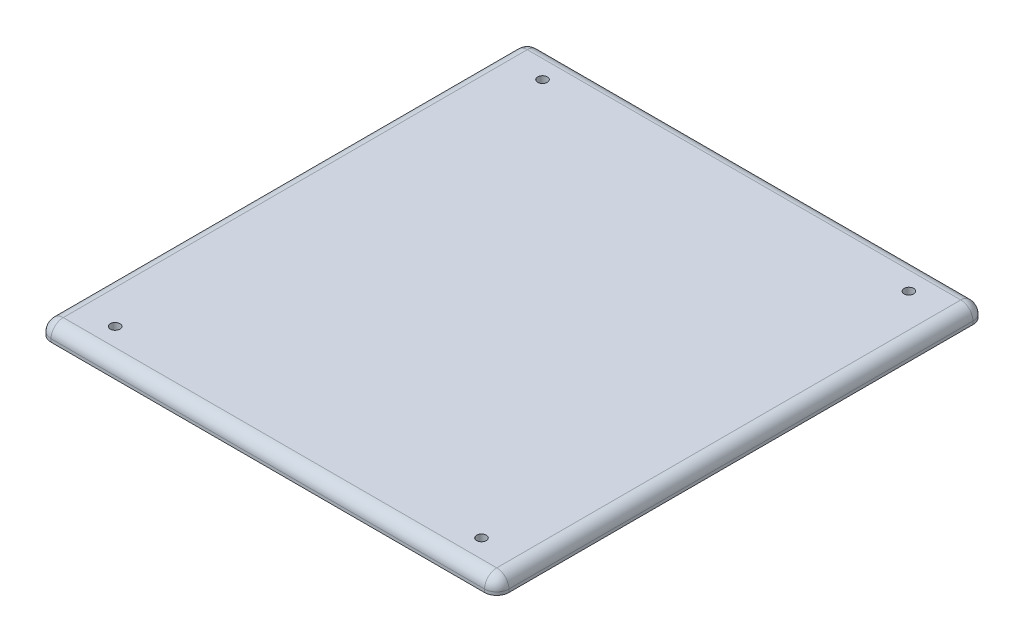
ISO-10303-21;
HEADER;
FILE_DESCRIPTION(('STEP AP214'),'2;1');
FILE_NAME('part.step','',(''),(''),'','','');
FILE_SCHEMA(('AUTOMOTIVE_DESIGN { 1 0 10303 214 1 1 1 1 }'));
ENDSEC;
DATA;
#1=APPLICATION_CONTEXT('core data for automotive mechanical design processes');
#2=APPLICATION_PROTOCOL_DEFINITION('international standard','automotive_design',2000,#1);
#3=PRODUCT_CONTEXT('',#1,'mechanical');
#4=PRODUCT('Part','Part','',(#3));
#5=PRODUCT_RELATED_PRODUCT_CATEGORY('part','',(#4));
#6=PRODUCT_DEFINITION_FORMATION('','',#4);
#7=PRODUCT_DEFINITION_CONTEXT('part definition',#1,'design');
#8=PRODUCT_DEFINITION('design','',#6,#7);
#9=PRODUCT_DEFINITION_SHAPE('','',#8);
#10=(LENGTH_UNIT() NAMED_UNIT(*) SI_UNIT(.MILLI.,.METRE.));
#11=(NAMED_UNIT(*) PLANE_ANGLE_UNIT() SI_UNIT($,.RADIAN.));
#12=(NAMED_UNIT(*) SI_UNIT($,.STERADIAN.) SOLID_ANGLE_UNIT());
#13=UNCERTAINTY_MEASURE_WITH_UNIT(LENGTH_MEASURE(1.E-05),#10,'distance_accuracy_value','');
#14=(GEOMETRIC_REPRESENTATION_CONTEXT(3) GLOBAL_UNCERTAINTY_ASSIGNED_CONTEXT((#13)) GLOBAL_UNIT_ASSIGNED_CONTEXT((#10,
#11,#12)) REPRESENTATION_CONTEXT('',''));
#15=CARTESIAN_POINT('',(0.,0.,0.));
#16=DIRECTION('',(0.,0.,1.));
#17=DIRECTION('',(1.,0.,0.));
#18=AXIS2_PLACEMENT_3D('',#15,#16,#17);
#19=CARTESIAN_POINT('',(-47.625,3.175,50.8));
#20=DIRECTION('',(1.,0.,0.));
#21=DIRECTION('',(0.,0.,-1.));
#22=AXIS2_PLACEMENT_3D('',#19,#20,#21);
#23=PLANE('',#22);
#24=DIRECTION('',(0.,0.,1.));
#25=VECTOR('',#24,1.);
#26=CARTESIAN_POINT('',(-47.625,0.635,-50.8));
#27=LINE('',#26,#25);
#28=CARTESIAN_POINT('',(-47.625,0.635,48.26));
#29=VERTEX_POINT('',#28);
#30=CARTESIAN_POINT('',(-47.625,0.635,-48.26));
#31=VERTEX_POINT('',#30);
#32=EDGE_CURVE('E191',#29,#31,#27,.F.);
#33=ORIENTED_EDGE('',*,*,#32,.T.);
#34=DIRECTION('',(0.,-1.,0.));
#35=VECTOR('',#34,1.);
#36=CARTESIAN_POINT('',(-47.625,3.175,-48.26));
#37=LINE('',#36,#35);
#38=CARTESIAN_POINT('',(-47.625,0.,-48.26));
#39=VERTEX_POINT('',#38);
#40=EDGE_CURVE('E194',#31,#39,#37,.T.);
#41=ORIENTED_EDGE('',*,*,#40,.T.);
#42=DIRECTION('',(0.,0.,1.));
#43=VECTOR('',#42,1.);
#44=CARTESIAN_POINT('',(-47.625,0.,50.8));
#45=LINE('',#44,#43);
#46=CARTESIAN_POINT('',(-47.625,0.,48.26));
#47=VERTEX_POINT('',#46);
#48=EDGE_CURVE('E296',#39,#47,#45,.T.);
#49=ORIENTED_EDGE('',*,*,#48,.T.);
#50=DIRECTION('',(0.,-1.,0.));
#51=VECTOR('',#50,1.);
#52=CARTESIAN_POINT('',(-47.625,3.175,48.26));
#53=LINE('',#52,#51);
#54=EDGE_CURVE('E188',#47,#29,#53,.F.);
#55=ORIENTED_EDGE('',*,*,#54,.T.);
#56=EDGE_LOOP('',(#33,#41,#49,#55));
#57=FACE_BOUND('',#56,.T.);
#58=ADVANCED_FACE('F47',(#57),#23,.F.);
#59=CARTESIAN_POINT('',(47.625,3.175,50.8));
#60=DIRECTION('',(0.,0.,-1.));
#61=DIRECTION('',(-1.,0.,0.));
#62=AXIS2_PLACEMENT_3D('',#59,#60,#61);
#63=PLANE('',#62);
#64=DIRECTION('',(1.,0.,0.));
#65=VECTOR('',#64,1.);
#66=CARTESIAN_POINT('',(47.625,0.,50.8));
#67=LINE('',#66,#65);
#68=CARTESIAN_POINT('',(-45.085,0.,50.8));
#69=VERTEX_POINT('',#68);
#70=CARTESIAN_POINT('',(45.085,0.,50.8));
#71=VERTEX_POINT('',#70);
#72=EDGE_CURVE('E304',#69,#71,#67,.T.);
#73=ORIENTED_EDGE('',*,*,#72,.T.);
#74=DIRECTION('',(0.,-1.,0.));
#75=VECTOR('',#74,1.);
#76=CARTESIAN_POINT('',(45.085,3.175,50.8));
#77=LINE('',#76,#75);
#78=CARTESIAN_POINT('',(45.085,0.635,50.8));
#79=VERTEX_POINT('',#78);
#80=EDGE_CURVE('E185',#71,#79,#77,.F.);
#81=ORIENTED_EDGE('',*,*,#80,.T.);
#82=DIRECTION('',(1.,0.,0.));
#83=VECTOR('',#82,1.);
#84=CARTESIAN_POINT('',(-47.625,0.635,50.8));
#85=LINE('',#84,#83);
#86=CARTESIAN_POINT('',(-45.085,0.635,50.8));
#87=VERTEX_POINT('',#86);
#88=EDGE_CURVE('E182',#79,#87,#85,.F.);
#89=ORIENTED_EDGE('',*,*,#88,.T.);
#90=DIRECTION('',(0.,-1.,0.));
#91=VECTOR('',#90,1.);
#92=CARTESIAN_POINT('',(-45.085,3.175,50.8));
#93=LINE('',#92,#91);
#94=EDGE_CURVE('E179',#87,#69,#93,.T.);
#95=ORIENTED_EDGE('',*,*,#94,.T.);
#96=EDGE_LOOP('',(#73,#81,#89,#95));
#97=FACE_BOUND('',#96,.T.);
#98=ADVANCED_FACE('F365',(#97),#63,.F.);
#99=CARTESIAN_POINT('',(47.625,3.175,50.8));
#100=DIRECTION('',(-1.,0.,0.));
#101=DIRECTION('',(0.,0.,1.));
#102=AXIS2_PLACEMENT_3D('',#99,#100,#101);
#103=PLANE('',#102);
#104=DIRECTION('',(0.,0.,-1.));
#105=VECTOR('',#104,1.);
#106=CARTESIAN_POINT('',(47.625,0.,50.8));
#107=LINE('',#106,#105);
#108=CARTESIAN_POINT('',(47.625,0.,48.26));
#109=VERTEX_POINT('',#108);
#110=CARTESIAN_POINT('',(47.625,0.,-48.26));
#111=VERTEX_POINT('',#110);
#112=EDGE_CURVE('E323',#109,#111,#107,.T.);
#113=ORIENTED_EDGE('',*,*,#112,.T.);
#114=DIRECTION('',(0.,-1.,0.));
#115=VECTOR('',#114,1.);
#116=CARTESIAN_POINT('',(47.625,3.175,-48.26));
#117=LINE('',#116,#115);
#118=CARTESIAN_POINT('',(47.625,0.635,-48.26));
#119=VERTEX_POINT('',#118);
#120=EDGE_CURVE('E176',#111,#119,#117,.F.);
#121=ORIENTED_EDGE('',*,*,#120,.T.);
#122=DIRECTION('',(0.,0.,-1.));
#123=VECTOR('',#122,1.);
#124=CARTESIAN_POINT('',(47.625,0.635,50.8));
#125=LINE('',#124,#123);
#126=CARTESIAN_POINT('',(47.625,0.635,48.26));
#127=VERTEX_POINT('',#126);
#128=EDGE_CURVE('E133',#119,#127,#125,.F.);
#129=ORIENTED_EDGE('',*,*,#128,.T.);
#130=DIRECTION('',(0.,-1.,0.));
#131=VECTOR('',#130,1.);
#132=CARTESIAN_POINT('',(47.625,3.175,48.26));
#133=LINE('',#132,#131);
#134=EDGE_CURVE('E166',#127,#109,#133,.T.);
#135=ORIENTED_EDGE('',*,*,#134,.T.);
#136=EDGE_LOOP('',(#113,#121,#129,#135));
#137=FACE_BOUND('',#136,.T.);
#138=ADVANCED_FACE('F370',(#137),#103,.F.);
#139=CARTESIAN_POINT('',(47.625,3.175,-50.8));
#140=DIRECTION('',(0.,0.,1.));
#141=DIRECTION('',(1.,0.,0.));
#142=AXIS2_PLACEMENT_3D('',#139,#140,#141);
#143=PLANE('',#142);
#144=DIRECTION('',(-1.,0.,0.));
#145=VECTOR('',#144,1.);
#146=CARTESIAN_POINT('',(47.625,0.,-50.8));
#147=LINE('',#146,#145);
#148=CARTESIAN_POINT('',(45.085,0.,-50.8));
#149=VERTEX_POINT('',#148);
#150=CARTESIAN_POINT('',(-45.085,0.,-50.8));
#151=VERTEX_POINT('',#150);
#152=EDGE_CURVE('E158',#149,#151,#147,.T.);
#153=ORIENTED_EDGE('',*,*,#152,.T.);
#154=DIRECTION('',(0.,-1.,0.));
#155=VECTOR('',#154,1.);
#156=CARTESIAN_POINT('',(-45.085,3.175,-50.8));
#157=LINE('',#156,#155);
#158=CARTESIAN_POINT('',(-45.085,0.635,-50.8));
#159=VERTEX_POINT('',#158);
#160=EDGE_CURVE('E64',#151,#159,#157,.F.);
#161=ORIENTED_EDGE('',*,*,#160,.T.);
#162=DIRECTION('',(-1.,0.,0.));
#163=VECTOR('',#162,1.);
#164=CARTESIAN_POINT('',(47.625,0.635,-50.8));
#165=LINE('',#164,#163);
#166=CARTESIAN_POINT('',(45.085,0.635,-50.8));
#167=VERTEX_POINT('',#166);
#168=EDGE_CURVE('E69',#159,#167,#165,.F.);
#169=ORIENTED_EDGE('',*,*,#168,.T.);
#170=DIRECTION('',(0.,-1.,0.));
#171=VECTOR('',#170,1.);
#172=CARTESIAN_POINT('',(45.085,3.175,-50.8));
#173=LINE('',#172,#171);
#174=EDGE_CURVE('E197',#167,#149,#173,.T.);
#175=ORIENTED_EDGE('',*,*,#174,.T.);
#176=EDGE_LOOP('',(#153,#161,#169,#175));
#177=FACE_BOUND('',#176,.T.);
#178=ADVANCED_FACE('F348',(#177),#143,.F.);
#179=CARTESIAN_POINT('',(0.,3.175,0.));
#180=DIRECTION('',(0.,1.,0.));
#181=DIRECTION('',(0.,0.,1.));
#182=AXIS2_PLACEMENT_3D('',#179,#180,#181);
#183=PLANE('',#182);
#184=DIRECTION('',(1.,0.,0.));
#185=VECTOR('',#184,1.);
#186=CARTESIAN_POINT('',(47.625,3.175,48.26));
#187=LINE('',#186,#185);
#188=CARTESIAN_POINT('',(-45.085,3.175,48.26));
#189=VERTEX_POINT('',#188);
#190=CARTESIAN_POINT('',(45.085,3.175,48.26));
#191=VERTEX_POINT('',#190);
#192=EDGE_CURVE('E163',#189,#191,#187,.T.);
#193=ORIENTED_EDGE('',*,*,#192,.T.);
#194=DIRECTION('',(0.,0.,-1.));
#195=VECTOR('',#194,1.);
#196=CARTESIAN_POINT('',(45.085,3.175,-50.8));
#197=LINE('',#196,#195);
#198=CARTESIAN_POINT('',(45.085,3.175,-48.26));
#199=VERTEX_POINT('',#198);
#200=EDGE_CURVE('E131',#191,#199,#197,.T.);
#201=ORIENTED_EDGE('',*,*,#200,.T.);
#202=DIRECTION('',(-1.,0.,0.));
#203=VECTOR('',#202,1.);
#204=CARTESIAN_POINT('',(-47.625,3.175,-48.26));
#205=LINE('',#204,#203);
#206=CARTESIAN_POINT('',(-45.085,3.175,-48.26));
#207=VERTEX_POINT('',#206);
#208=EDGE_CURVE('E150',#199,#207,#205,.T.);
#209=ORIENTED_EDGE('',*,*,#208,.T.);
#210=DIRECTION('',(0.,0.,1.));
#211=VECTOR('',#210,1.);
#212=CARTESIAN_POINT('',(-45.085,3.175,50.8));
#213=LINE('',#212,#211);
#214=EDGE_CURVE('E157',#207,#189,#213,.T.);
#215=ORIENTED_EDGE('',*,*,#214,.T.);
#216=EDGE_LOOP('',(#193,#201,#209,#215));
#217=FACE_BOUND('',#216,.T.);
#218=CARTESIAN_POINT('',(38.1,3.175,-44.45));
#219=DIRECTION('',(0.,1.,0.));
#220=DIRECTION('',(0.,0.,-1.));
#221=AXIS2_PLACEMENT_3D('',#218,#219,#220);
#222=CIRCLE('',#221,0.999490000000001);
#223=CARTESIAN_POINT('',(38.1,3.175,-45.44949));
#224=VERTEX_POINT('',#223);
#225=EDGE_CURVE('E334',#224,#224,#222,.T.);
#226=ORIENTED_EDGE('',*,*,#225,.F.);
#227=EDGE_LOOP('',(#226));
#228=FACE_BOUND('',#227,.T.);
#229=CARTESIAN_POINT('',(-38.1,3.175,-44.45));
#230=DIRECTION('',(0.,1.,0.));
#231=DIRECTION('',(0.,0.,1.));
#232=AXIS2_PLACEMENT_3D('',#229,#230,#231);
#233=CIRCLE('',#232,0.999490000000001);
#234=CARTESIAN_POINT('',(-38.1,3.175,-43.45051));
#235=VERTEX_POINT('',#234);
#236=EDGE_CURVE('E250',#235,#235,#233,.T.);
#237=ORIENTED_EDGE('',*,*,#236,.F.);
#238=EDGE_LOOP('',(#237));
#239=FACE_BOUND('',#238,.T.);
#240=CARTESIAN_POINT('',(-38.1,3.175,44.45));
#241=DIRECTION('',(0.,1.,0.));
#242=DIRECTION('',(0.,0.,1.));
#243=AXIS2_PLACEMENT_3D('',#240,#241,#242);
#244=CIRCLE('',#243,0.999490000000001);
#245=CARTESIAN_POINT('',(-38.1,3.175,45.44949));
#246=VERTEX_POINT('',#245);
#247=EDGE_CURVE('E305',#246,#246,#244,.T.);
#248=ORIENTED_EDGE('',*,*,#247,.F.);
#249=EDGE_LOOP('',(#248));
#250=FACE_BOUND('',#249,.T.);
#251=CARTESIAN_POINT('',(38.1,3.175,44.45));
#252=DIRECTION('',(0.,1.,0.));
#253=DIRECTION('',(0.,0.,-1.));
#254=AXIS2_PLACEMENT_3D('',#251,#252,#253);
#255=CIRCLE('',#254,0.999490000000001);
#256=CARTESIAN_POINT('',(38.1,3.175,43.45051));
#257=VERTEX_POINT('',#256);
#258=EDGE_CURVE('E330',#257,#257,#255,.T.);
#259=ORIENTED_EDGE('',*,*,#258,.F.);
#260=EDGE_LOOP('',(#259));
#261=FACE_BOUND('',#260,.T.);
#262=ADVANCED_FACE('F160',(#217,#228,#239,#250,#261),#183,.T.);
#263=CARTESIAN_POINT('',(0.,0.,0.));
#264=DIRECTION('',(0.,1.,0.));
#265=DIRECTION('',(0.,0.,1.));
#266=AXIS2_PLACEMENT_3D('',#263,#264,#265);
#267=PLANE('',#266);
#268=CARTESIAN_POINT('',(38.1,0.,-44.45));
#269=DIRECTION('',(0.,1.,0.));
#270=DIRECTION('',(0.,0.,1.));
#271=AXIS2_PLACEMENT_3D('',#268,#269,#270);
#272=CIRCLE('',#271,2.26948999999996);
#273=CARTESIAN_POINT('',(38.1,0.,-42.18051));
#274=VERTEX_POINT('',#273);
#275=EDGE_CURVE('E262',#274,#274,#272,.T.);
#276=ORIENTED_EDGE('',*,*,#275,.T.);
#277=EDGE_LOOP('',(#276));
#278=FACE_BOUND('',#277,.T.);
#279=CARTESIAN_POINT('',(-38.1,0.,-44.45));
#280=DIRECTION('',(0.,1.,0.));
#281=DIRECTION('',(0.,0.,1.));
#282=AXIS2_PLACEMENT_3D('',#279,#280,#281);
#283=CIRCLE('',#282,2.26948999999996);
#284=CARTESIAN_POINT('',(-38.1,0.,-42.18051));
#285=VERTEX_POINT('',#284);
#286=EDGE_CURVE('E258',#285,#285,#283,.T.);
#287=ORIENTED_EDGE('',*,*,#286,.T.);
#288=EDGE_LOOP('',(#287));
#289=FACE_BOUND('',#288,.T.);
#290=CARTESIAN_POINT('',(-38.1,0.,44.45));
#291=DIRECTION('',(0.,1.,0.));
#292=DIRECTION('',(0.,0.,1.));
#293=AXIS2_PLACEMENT_3D('',#290,#291,#292);
#294=CIRCLE('',#293,2.26948999999996);
#295=CARTESIAN_POINT('',(-38.1,0.,46.71949));
#296=VERTEX_POINT('',#295);
#297=EDGE_CURVE('E254',#296,#296,#294,.T.);
#298=ORIENTED_EDGE('',*,*,#297,.T.);
#299=EDGE_LOOP('',(#298));
#300=FACE_BOUND('',#299,.T.);
#301=CARTESIAN_POINT('',(38.1,0.,44.45));
#302=DIRECTION('',(0.,1.,0.));
#303=DIRECTION('',(0.,0.,1.));
#304=AXIS2_PLACEMENT_3D('',#301,#302,#303);
#305=CIRCLE('',#304,2.26948999999996);
#306=CARTESIAN_POINT('',(38.1,0.,46.71949));
#307=VERTEX_POINT('',#306);
#308=EDGE_CURVE('E215',#307,#307,#305,.T.);
#309=ORIENTED_EDGE('',*,*,#308,.T.);
#310=EDGE_LOOP('',(#309));
#311=FACE_BOUND('',#310,.T.);
#312=ORIENTED_EDGE('',*,*,#48,.F.);
#313=CARTESIAN_POINT('',(-45.085,0.,-48.26));
#314=DIRECTION('',(0.,1.,0.));
#315=DIRECTION('',(0.,0.,1.));
#316=AXIS2_PLACEMENT_3D('',#313,#314,#315);
#317=CIRCLE('',#316,2.54);
#318=EDGE_CURVE('E213',#39,#151,#317,.F.);
#319=ORIENTED_EDGE('',*,*,#318,.T.);
#320=ORIENTED_EDGE('',*,*,#152,.F.);
#321=CARTESIAN_POINT('',(45.085,0.,-48.26));
#322=DIRECTION('',(0.,1.,0.));
#323=DIRECTION('',(0.,0.,1.));
#324=AXIS2_PLACEMENT_3D('',#321,#322,#323);
#325=CIRCLE('',#324,2.54);
#326=EDGE_CURVE('E210',#149,#111,#325,.F.);
#327=ORIENTED_EDGE('',*,*,#326,.T.);
#328=ORIENTED_EDGE('',*,*,#112,.F.);
#329=CARTESIAN_POINT('',(45.085,0.,48.26));
#330=DIRECTION('',(0.,1.,0.));
#331=DIRECTION('',(0.,0.,1.));
#332=AXIS2_PLACEMENT_3D('',#329,#330,#331);
#333=CIRCLE('',#332,2.54);
#334=EDGE_CURVE('E207',#109,#71,#333,.F.);
#335=ORIENTED_EDGE('',*,*,#334,.T.);
#336=ORIENTED_EDGE('',*,*,#72,.F.);
#337=CARTESIAN_POINT('',(-45.085,0.,48.26));
#338=DIRECTION('',(0.,1.,0.));
#339=DIRECTION('',(0.,0.,1.));
#340=AXIS2_PLACEMENT_3D('',#337,#338,#339);
#341=CIRCLE('',#340,2.54);
#342=EDGE_CURVE('E204',#69,#47,#341,.F.);
#343=ORIENTED_EDGE('',*,*,#342,.T.);
#344=EDGE_LOOP('',(#312,#319,#320,#327,#328,#335,#336,#343));
#345=FACE_BOUND('',#344,.T.);
#346=ADVANCED_FACE('F286',(#278,#289,#300,#311,#345),#267,.F.);
#347=CARTESIAN_POINT('',(38.1,0.,44.45));
#348=DIRECTION('',(0.,1.,0.));
#349=DIRECTION('',(0.,0.,1.));
#350=AXIS2_PLACEMENT_3D('',#347,#348,#349);
#351=CYLINDRICAL_SURFACE('',#350,0.999490000000001);
#352=CARTESIAN_POINT('',(38.1,1.26999999999998,44.45));
#353=DIRECTION('',(0.,1.,0.));
#354=DIRECTION('',(0.,0.,1.));
#355=AXIS2_PLACEMENT_3D('',#352,#353,#354);
#356=CIRCLE('',#355,0.999490000000001);
#357=CARTESIAN_POINT('',(38.1,1.26999999999998,45.44949));
#358=VERTEX_POINT('',#357);
#359=EDGE_CURVE('E11',#358,#358,#356,.F.);
#360=ORIENTED_EDGE('',*,*,#359,.T.);
#361=EDGE_LOOP('',(#360));
#362=FACE_BOUND('',#361,.T.);
#363=ORIENTED_EDGE('',*,*,#258,.T.);
#364=EDGE_LOOP('',(#363));
#365=FACE_BOUND('',#364,.T.);
#366=ADVANCED_FACE('F289',(#362,#365),#351,.F.);
#367=CARTESIAN_POINT('',(-38.1,0.,44.45));
#368=DIRECTION('',(0.,1.,0.));
#369=DIRECTION('',(0.,0.,1.));
#370=AXIS2_PLACEMENT_3D('',#367,#368,#369);
#371=CYLINDRICAL_SURFACE('',#370,0.999490000000001);
#372=CARTESIAN_POINT('',(-38.1,1.26999999999998,44.45));
#373=DIRECTION('',(0.,1.,0.));
#374=DIRECTION('',(0.,0.,1.));
#375=AXIS2_PLACEMENT_3D('',#372,#373,#374);
#376=CIRCLE('',#375,0.999490000000001);
#377=CARTESIAN_POINT('',(-38.1,1.26999999999998,45.44949));
#378=VERTEX_POINT('',#377);
#379=EDGE_CURVE('E57',#378,#378,#376,.F.);
#380=ORIENTED_EDGE('',*,*,#379,.T.);
#381=EDGE_LOOP('',(#380));
#382=FACE_BOUND('',#381,.T.);
#383=ORIENTED_EDGE('',*,*,#247,.T.);
#384=EDGE_LOOP('',(#383));
#385=FACE_BOUND('',#384,.T.);
#386=ADVANCED_FACE('F277',(#382,#385),#371,.F.);
#387=CARTESIAN_POINT('',(-38.1,0.,-44.45));
#388=DIRECTION('',(0.,1.,0.));
#389=DIRECTION('',(0.,0.,1.));
#390=AXIS2_PLACEMENT_3D('',#387,#388,#389);
#391=CYLINDRICAL_SURFACE('',#390,0.999490000000001);
#392=CARTESIAN_POINT('',(-38.1,1.26999999999998,-44.45));
#393=DIRECTION('',(0.,1.,0.));
#394=DIRECTION('',(0.,0.,1.));
#395=AXIS2_PLACEMENT_3D('',#392,#393,#394);
#396=CIRCLE('',#395,0.999490000000001);
#397=CARTESIAN_POINT('',(-38.1,1.26999999999998,-43.45051));
#398=VERTEX_POINT('',#397);
#399=EDGE_CURVE('E270',#398,#398,#396,.F.);
#400=ORIENTED_EDGE('',*,*,#399,.T.);
#401=EDGE_LOOP('',(#400));
#402=FACE_BOUND('',#401,.T.);
#403=ORIENTED_EDGE('',*,*,#236,.T.);
#404=EDGE_LOOP('',(#403));
#405=FACE_BOUND('',#404,.T.);
#406=ADVANCED_FACE('F362',(#402,#405),#391,.F.);
#407=CARTESIAN_POINT('',(38.1,0.,-44.45));
#408=DIRECTION('',(0.,1.,0.));
#409=DIRECTION('',(0.,0.,1.));
#410=AXIS2_PLACEMENT_3D('',#407,#408,#409);
#411=CYLINDRICAL_SURFACE('',#410,0.999490000000001);
#412=CARTESIAN_POINT('',(38.1,1.26999999999998,-44.45));
#413=DIRECTION('',(0.,1.,0.));
#414=DIRECTION('',(0.,0.,1.));
#415=AXIS2_PLACEMENT_3D('',#412,#413,#414);
#416=CIRCLE('',#415,0.999490000000001);
#417=CARTESIAN_POINT('',(38.1,1.26999999999998,-43.45051));
#418=VERTEX_POINT('',#417);
#419=EDGE_CURVE('E266',#418,#418,#416,.F.);
#420=ORIENTED_EDGE('',*,*,#419,.T.);
#421=EDGE_LOOP('',(#420));
#422=FACE_BOUND('',#421,.T.);
#423=ORIENTED_EDGE('',*,*,#225,.T.);
#424=EDGE_LOOP('',(#423));
#425=FACE_BOUND('',#424,.T.);
#426=ADVANCED_FACE('F345',(#422,#425),#411,.F.);
#427=CARTESIAN_POINT('',(-45.085,3.175,48.26));
#428=DIRECTION('',(0.,-1.,0.));
#429=DIRECTION('',(0.,0.,-1.));
#430=AXIS2_PLACEMENT_3D('',#427,#428,#429);
#431=CYLINDRICAL_SURFACE('',#430,2.54);
#432=ORIENTED_EDGE('',*,*,#342,.F.);
#433=ORIENTED_EDGE('',*,*,#94,.F.);
#434=CARTESIAN_POINT('',(-45.085,0.635,48.26));
#435=DIRECTION('',(0.,1.,0.));
#436=DIRECTION('',(0.,0.,1.));
#437=AXIS2_PLACEMENT_3D('',#434,#435,#436);
#438=CIRCLE('',#437,2.54);
#439=EDGE_CURVE('E246',#29,#87,#438,.T.);
#440=ORIENTED_EDGE('',*,*,#439,.F.);
#441=ORIENTED_EDGE('',*,*,#54,.F.);
#442=EDGE_LOOP('',(#432,#433,#440,#441));
#443=FACE_BOUND('',#442,.T.);
#444=ADVANCED_FACE('F408',(#443),#431,.T.);
#445=CARTESIAN_POINT('',(-45.085,0.635,0.));
#446=DIRECTION('',(0.,0.,-1.));
#447=DIRECTION('',(-1.,0.,0.));
#448=AXIS2_PLACEMENT_3D('',#445,#446,#447);
#449=CYLINDRICAL_SURFACE('',#448,2.54);
#450=CARTESIAN_POINT('',(-45.085,0.635,-48.26));
#451=DIRECTION('',(0.,0.,-1.));
#452=DIRECTION('',(-1.,0.,0.));
#453=AXIS2_PLACEMENT_3D('',#450,#451,#452);
#454=CIRCLE('',#453,2.54);
#455=EDGE_CURVE('E238',#31,#207,#454,.T.);
#456=ORIENTED_EDGE('',*,*,#455,.F.);
#457=ORIENTED_EDGE('',*,*,#32,.F.);
#458=CARTESIAN_POINT('',(-45.085,0.635,48.26));
#459=DIRECTION('',(0.,0.,1.));
#460=DIRECTION('',(1.,0.,0.));
#461=AXIS2_PLACEMENT_3D('',#458,#459,#460);
#462=CIRCLE('',#461,2.54);
#463=EDGE_CURVE('E242',#189,#29,#462,.T.);
#464=ORIENTED_EDGE('',*,*,#463,.F.);
#465=ORIENTED_EDGE('',*,*,#214,.F.);
#466=EDGE_LOOP('',(#456,#457,#464,#465));
#467=FACE_BOUND('',#466,.T.);
#468=ADVANCED_FACE('F315',(#467),#449,.T.);
#469=CARTESIAN_POINT('',(-45.085,3.175,-48.26));
#470=DIRECTION('',(0.,-1.,0.));
#471=DIRECTION('',(0.,0.,-1.));
#472=AXIS2_PLACEMENT_3D('',#469,#470,#471);
#473=CYLINDRICAL_SURFACE('',#472,2.54);
#474=ORIENTED_EDGE('',*,*,#318,.F.);
#475=ORIENTED_EDGE('',*,*,#40,.F.);
#476=CARTESIAN_POINT('',(-45.085,0.635,-48.26));
#477=DIRECTION('',(0.,1.,0.));
#478=DIRECTION('',(0.,0.,1.));
#479=AXIS2_PLACEMENT_3D('',#476,#477,#478);
#480=CIRCLE('',#479,2.54);
#481=EDGE_CURVE('E234',#159,#31,#480,.T.);
#482=ORIENTED_EDGE('',*,*,#481,.F.);
#483=ORIENTED_EDGE('',*,*,#160,.F.);
#484=EDGE_LOOP('',(#474,#475,#482,#483));
#485=FACE_BOUND('',#484,.T.);
#486=ADVANCED_FACE('F309',(#485),#473,.T.);
#487=CARTESIAN_POINT('',(-45.085,0.635,48.26));
#488=DIRECTION('',(-1.,0.,0.));
#489=DIRECTION('',(0.,0.,1.));
#490=AXIS2_PLACEMENT_3D('',#487,#488,#489);
#491=SPHERICAL_SURFACE('',#490,2.54);
#492=ORIENTED_EDGE('',*,*,#463,.T.);
#493=ORIENTED_EDGE('',*,*,#439,.T.);
#494=CARTESIAN_POINT('',(-45.085,0.635,48.26));
#495=DIRECTION('',(-1.,0.,0.));
#496=DIRECTION('',(0.,0.,1.));
#497=AXIS2_PLACEMENT_3D('',#494,#495,#496);
#498=CIRCLE('',#497,2.54);
#499=EDGE_CURVE('E230',#189,#87,#498,.F.);
#500=ORIENTED_EDGE('',*,*,#499,.F.);
#501=EDGE_LOOP('',(#492,#493,#500));
#502=FACE_BOUND('',#501,.T.);
#503=ADVANCED_FACE('F400',(#502),#491,.T.);
#504=CARTESIAN_POINT('',(-45.085,0.635,-48.26));
#505=DIRECTION('',(-1.,0.,0.));
#506=DIRECTION('',(0.,0.,1.));
#507=AXIS2_PLACEMENT_3D('',#504,#505,#506);
#508=SPHERICAL_SURFACE('',#507,2.54);
#509=ORIENTED_EDGE('',*,*,#481,.T.);
#510=ORIENTED_EDGE('',*,*,#455,.T.);
#511=CARTESIAN_POINT('',(-45.085,0.635,-48.26));
#512=DIRECTION('',(-1.,0.,0.));
#513=DIRECTION('',(0.,0.,1.));
#514=AXIS2_PLACEMENT_3D('',#511,#512,#513);
#515=CIRCLE('',#514,2.54);
#516=EDGE_CURVE('E153',#159,#207,#515,.F.);
#517=ORIENTED_EDGE('',*,*,#516,.F.);
#518=EDGE_LOOP('',(#509,#510,#517));
#519=FACE_BOUND('',#518,.T.);
#520=ADVANCED_FACE('F312',(#519),#508,.T.);
#521=CARTESIAN_POINT('',(45.085,3.175,48.26));
#522=DIRECTION('',(0.,-1.,0.));
#523=DIRECTION('',(0.,0.,-1.));
#524=AXIS2_PLACEMENT_3D('',#521,#522,#523);
#525=CYLINDRICAL_SURFACE('',#524,2.54);
#526=ORIENTED_EDGE('',*,*,#334,.F.);
#527=ORIENTED_EDGE('',*,*,#134,.F.);
#528=CARTESIAN_POINT('',(45.085,0.635,48.26));
#529=DIRECTION('',(0.,1.,0.));
#530=DIRECTION('',(0.,0.,1.));
#531=AXIS2_PLACEMENT_3D('',#528,#529,#530);
#532=CIRCLE('',#531,2.54);
#533=EDGE_CURVE('E224',#79,#127,#532,.T.);
#534=ORIENTED_EDGE('',*,*,#533,.F.);
#535=ORIENTED_EDGE('',*,*,#80,.F.);
#536=EDGE_LOOP('',(#526,#527,#534,#535));
#537=FACE_BOUND('',#536,.T.);
#538=ADVANCED_FACE('F393',(#537),#525,.T.);
#539=CARTESIAN_POINT('',(0.,0.635,48.26));
#540=DIRECTION('',(-1.,0.,0.));
#541=DIRECTION('',(0.,0.,1.));
#542=AXIS2_PLACEMENT_3D('',#539,#540,#541);
#543=CYLINDRICAL_SURFACE('',#542,2.54);
#544=ORIENTED_EDGE('',*,*,#499,.T.);
#545=ORIENTED_EDGE('',*,*,#88,.F.);
#546=CARTESIAN_POINT('',(45.085,0.635,48.26));
#547=DIRECTION('',(1.,0.,0.));
#548=DIRECTION('',(0.,0.,-1.));
#549=AXIS2_PLACEMENT_3D('',#546,#547,#548);
#550=CIRCLE('',#549,2.54);
#551=EDGE_CURVE('E147',#191,#79,#550,.T.);
#552=ORIENTED_EDGE('',*,*,#551,.F.);
#553=ORIENTED_EDGE('',*,*,#192,.F.);
#554=EDGE_LOOP('',(#544,#545,#552,#553));
#555=FACE_BOUND('',#554,.T.);
#556=ADVANCED_FACE('F390',(#555),#543,.T.);
#557=CARTESIAN_POINT('',(0.,0.635,-48.26));
#558=DIRECTION('',(1.,0.,0.));
#559=DIRECTION('',(0.,0.,-1.));
#560=AXIS2_PLACEMENT_3D('',#557,#558,#559);
#561=CYLINDRICAL_SURFACE('',#560,2.54);
#562=ORIENTED_EDGE('',*,*,#516,.T.);
#563=ORIENTED_EDGE('',*,*,#208,.F.);
#564=CARTESIAN_POINT('',(45.085,0.635,-48.26));
#565=DIRECTION('',(1.,0.,0.));
#566=DIRECTION('',(0.,0.,-1.));
#567=AXIS2_PLACEMENT_3D('',#564,#565,#566);
#568=CIRCLE('',#567,2.54);
#569=EDGE_CURVE('E140',#167,#199,#568,.T.);
#570=ORIENTED_EDGE('',*,*,#569,.F.);
#571=ORIENTED_EDGE('',*,*,#168,.F.);
#572=EDGE_LOOP('',(#562,#563,#570,#571));
#573=FACE_BOUND('',#572,.T.);
#574=ADVANCED_FACE('F151',(#573),#561,.T.);
#575=CARTESIAN_POINT('',(45.085,3.175,-48.26));
#576=DIRECTION('',(0.,-1.,0.));
#577=DIRECTION('',(0.,0.,-1.));
#578=AXIS2_PLACEMENT_3D('',#575,#576,#577);
#579=CYLINDRICAL_SURFACE('',#578,2.54);
#580=ORIENTED_EDGE('',*,*,#326,.F.);
#581=ORIENTED_EDGE('',*,*,#174,.F.);
#582=CARTESIAN_POINT('',(45.085,0.635,-48.26));
#583=DIRECTION('',(0.,1.,0.));
#584=DIRECTION('',(0.,0.,1.));
#585=AXIS2_PLACEMENT_3D('',#582,#583,#584);
#586=CIRCLE('',#585,2.54);
#587=EDGE_CURVE('E144',#119,#167,#586,.T.);
#588=ORIENTED_EDGE('',*,*,#587,.F.);
#589=ORIENTED_EDGE('',*,*,#120,.F.);
#590=EDGE_LOOP('',(#580,#581,#588,#589));
#591=FACE_BOUND('',#590,.T.);
#592=ADVANCED_FACE('F383',(#591),#579,.T.);
#593=CARTESIAN_POINT('',(45.085,0.635,48.26));
#594=DIRECTION('',(0.,0.,1.));
#595=DIRECTION('',(1.,0.,0.));
#596=AXIS2_PLACEMENT_3D('',#593,#594,#595);
#597=SPHERICAL_SURFACE('',#596,2.54);
#598=ORIENTED_EDGE('',*,*,#551,.T.);
#599=ORIENTED_EDGE('',*,*,#533,.T.);
#600=CARTESIAN_POINT('',(45.085,0.635,48.26));
#601=DIRECTION('',(0.,0.,1.));
#602=DIRECTION('',(1.,0.,0.));
#603=AXIS2_PLACEMENT_3D('',#600,#601,#602);
#604=CIRCLE('',#603,2.54);
#605=EDGE_CURVE('E137',#191,#127,#604,.F.);
#606=ORIENTED_EDGE('',*,*,#605,.F.);
#607=EDGE_LOOP('',(#598,#599,#606));
#608=FACE_BOUND('',#607,.T.);
#609=ADVANCED_FACE('F380',(#608),#597,.T.);
#610=CARTESIAN_POINT('',(45.085,0.635,-48.26));
#611=DIRECTION('',(0.,0.,-1.));
#612=DIRECTION('',(-1.,0.,0.));
#613=AXIS2_PLACEMENT_3D('',#610,#611,#612);
#614=SPHERICAL_SURFACE('',#613,2.54);
#615=ORIENTED_EDGE('',*,*,#587,.T.);
#616=ORIENTED_EDGE('',*,*,#569,.T.);
#617=CARTESIAN_POINT('',(45.085,0.635,-48.26));
#618=DIRECTION('',(0.,0.,-1.));
#619=DIRECTION('',(-1.,0.,0.));
#620=AXIS2_PLACEMENT_3D('',#617,#618,#619);
#621=CIRCLE('',#620,2.54);
#622=EDGE_CURVE('E127',#119,#199,#621,.F.);
#623=ORIENTED_EDGE('',*,*,#622,.F.);
#624=EDGE_LOOP('',(#615,#616,#623));
#625=FACE_BOUND('',#624,.T.);
#626=ADVANCED_FACE('F142',(#625),#614,.T.);
#627=CARTESIAN_POINT('',(45.085,0.635,0.));
#628=DIRECTION('',(0.,0.,1.));
#629=DIRECTION('',(1.,0.,0.));
#630=AXIS2_PLACEMENT_3D('',#627,#628,#629);
#631=CYLINDRICAL_SURFACE('',#630,2.54);
#632=ORIENTED_EDGE('',*,*,#605,.T.);
#633=ORIENTED_EDGE('',*,*,#128,.F.);
#634=ORIENTED_EDGE('',*,*,#622,.T.);
#635=ORIENTED_EDGE('',*,*,#200,.F.);
#636=EDGE_LOOP('',(#632,#633,#634,#635));
#637=FACE_BOUND('',#636,.T.);
#638=ADVANCED_FACE('F129',(#637),#631,.T.);
#639=CARTESIAN_POINT('',(38.1,0.,-44.45));
#640=DIRECTION('',(0.,-1.,0.));
#641=DIRECTION('',(0.,0.,-1.));
#642=AXIS2_PLACEMENT_3D('',#639,#640,#641);
#643=CONICAL_SURFACE('',#642,2.26948999999996,0.78539816339744);
#644=ORIENTED_EDGE('',*,*,#419,.F.);
#645=EDGE_LOOP('',(#644));
#646=FACE_BOUND('',#645,.T.);
#647=ORIENTED_EDGE('',*,*,#275,.F.);
#648=EDGE_LOOP('',(#647));
#649=FACE_BOUND('',#648,.T.);
#650=ADVANCED_FACE('F377',(#646,#649),#643,.F.);
#651=CARTESIAN_POINT('',(-38.1,0.,-44.45));
#652=DIRECTION('',(0.,-1.,0.));
#653=DIRECTION('',(0.,0.,-1.));
#654=AXIS2_PLACEMENT_3D('',#651,#652,#653);
#655=CONICAL_SURFACE('',#654,2.26948999999996,0.78539816339744);
#656=ORIENTED_EDGE('',*,*,#399,.F.);
#657=EDGE_LOOP('',(#656));
#658=FACE_BOUND('',#657,.T.);
#659=ORIENTED_EDGE('',*,*,#286,.F.);
#660=EDGE_LOOP('',(#659));
#661=FACE_BOUND('',#660,.T.);
#662=ADVANCED_FACE('F283',(#658,#661),#655,.F.);
#663=CARTESIAN_POINT('',(-38.1,0.,44.45));
#664=DIRECTION('',(0.,-1.,0.));
#665=DIRECTION('',(0.,0.,-1.));
#666=AXIS2_PLACEMENT_3D('',#663,#664,#665);
#667=CONICAL_SURFACE('',#666,2.26948999999996,0.78539816339744);
#668=ORIENTED_EDGE('',*,*,#379,.F.);
#669=EDGE_LOOP('',(#668));
#670=FACE_BOUND('',#669,.T.);
#671=ORIENTED_EDGE('',*,*,#297,.F.);
#672=EDGE_LOOP('',(#671));
#673=FACE_BOUND('',#672,.T.);
#674=ADVANCED_FACE('F280',(#670,#673),#667,.F.);
#675=CARTESIAN_POINT('',(38.1,0.,44.45));
#676=DIRECTION('',(0.,-1.,0.));
#677=DIRECTION('',(0.,0.,-1.));
#678=AXIS2_PLACEMENT_3D('',#675,#676,#677);
#679=CONICAL_SURFACE('',#678,2.26948999999996,0.78539816339744);
#680=ORIENTED_EDGE('',*,*,#359,.F.);
#681=EDGE_LOOP('',(#680));
#682=FACE_BOUND('',#681,.T.);
#683=ORIENTED_EDGE('',*,*,#308,.F.);
#684=EDGE_LOOP('',(#683));
#685=FACE_BOUND('',#684,.T.);
#686=ADVANCED_FACE('F50',(#682,#685),#679,.F.);
#687=CLOSED_SHELL('',(#58,#98,#138,#178,#262,#346,#366,#386,#406,#426,#444,#468,#486,#503,#520,
#538,#556,#574,#592,#609,#626,#638,#650,#662,#674,#686));
#688=MANIFOLD_SOLID_BREP('B2',#687);
#689=ADVANCED_BREP_SHAPE_REPRESENTATION('',(#18,#688),#14);
#690=SHAPE_DEFINITION_REPRESENTATION(#9,#689);
ENDSEC;
END-ISO-10303-21;
